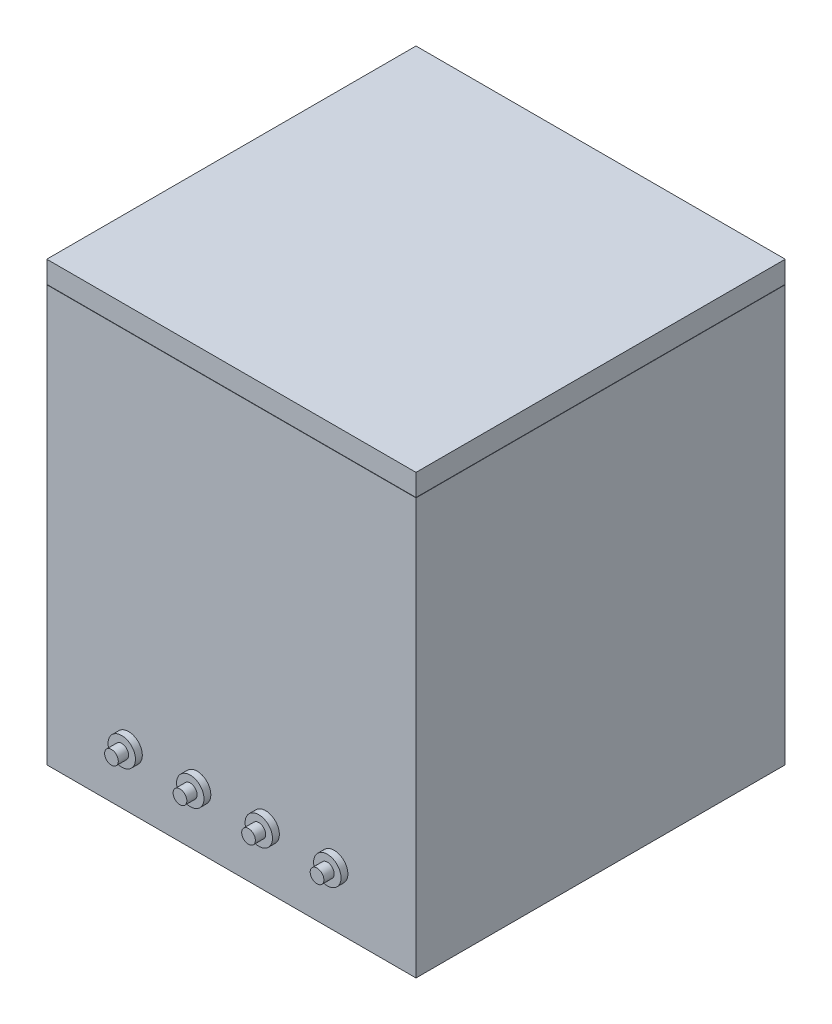
ISO-10303-21;
HEADER;
FILE_DESCRIPTION(('STEP AP214'),'2;1');
FILE_NAME('part.step','',(''),(''),'','','');
FILE_SCHEMA(('AUTOMOTIVE_DESIGN { 1 0 10303 214 1 1 1 1 }'));
ENDSEC;
DATA;
#1=APPLICATION_CONTEXT('core data for automotive mechanical design processes');
#2=APPLICATION_PROTOCOL_DEFINITION('international standard','automotive_design',2000,#1);
#3=PRODUCT_CONTEXT('',#1,'mechanical');
#4=PRODUCT('Part','Part','',(#3));
#5=PRODUCT_RELATED_PRODUCT_CATEGORY('part','',(#4));
#6=PRODUCT_DEFINITION_FORMATION('','',#4);
#7=PRODUCT_DEFINITION_CONTEXT('part definition',#1,'design');
#8=PRODUCT_DEFINITION('design','',#6,#7);
#9=PRODUCT_DEFINITION_SHAPE('','',#8);
#10=(LENGTH_UNIT() NAMED_UNIT(*) SI_UNIT(.MILLI.,.METRE.));
#11=(NAMED_UNIT(*) PLANE_ANGLE_UNIT() SI_UNIT($,.RADIAN.));
#12=(NAMED_UNIT(*) SI_UNIT($,.STERADIAN.) SOLID_ANGLE_UNIT());
#13=UNCERTAINTY_MEASURE_WITH_UNIT(LENGTH_MEASURE(1.E-05),#10,'distance_accuracy_value','');
#14=(GEOMETRIC_REPRESENTATION_CONTEXT(3) GLOBAL_UNCERTAINTY_ASSIGNED_CONTEXT((#13)) GLOBAL_UNIT_ASSIGNED_CONTEXT((#10,
#11,#12)) REPRESENTATION_CONTEXT('',''));
#15=CARTESIAN_POINT('',(0.,0.,0.));
#16=DIRECTION('',(0.,0.,1.));
#17=DIRECTION('',(1.,0.,0.));
#18=AXIS2_PLACEMENT_3D('',#15,#16,#17);
#19=CARTESIAN_POINT('',(53.8815367264149,121.45,-53.881536726415));
#20=DIRECTION('',(-1.,0.,0.));
#21=DIRECTION('',(0.,0.,1.));
#22=AXIS2_PLACEMENT_3D('',#19,#20,#21);
#23=PLANE('',#22);
#24=DIRECTION('',(0.,0.,-1.));
#25=VECTOR('',#24,1.);
#26=CARTESIAN_POINT('',(53.8815367264149,115.1,-53.881536726415));
#27=LINE('',#26,#25);
#28=CARTESIAN_POINT('',(53.8815367264149,115.1,53.881536726415));
#29=VERTEX_POINT('',#28);
#30=CARTESIAN_POINT('',(53.8815367264149,115.1,-53.881536726415));
#31=VERTEX_POINT('',#30);
#32=EDGE_CURVE('E117',#29,#31,#27,.T.);
#33=ORIENTED_EDGE('',*,*,#32,.T.);
#34=DIRECTION('',(0.,-1.,0.));
#35=VECTOR('',#34,1.);
#36=CARTESIAN_POINT('',(53.8815367264149,121.45,-53.881536726415));
#37=LINE('',#36,#35);
#38=CARTESIAN_POINT('',(53.8815367264149,121.45,-53.881536726415));
#39=VERTEX_POINT('',#38);
#40=EDGE_CURVE('E12',#39,#31,#37,.T.);
#41=ORIENTED_EDGE('',*,*,#40,.F.);
#42=DIRECTION('',(0.,0.,-1.));
#43=VECTOR('',#42,1.);
#44=CARTESIAN_POINT('',(53.8815367264149,121.45,-53.881536726415));
#45=LINE('',#44,#43);
#46=CARTESIAN_POINT('',(53.8815367264149,121.45,53.881536726415));
#47=VERTEX_POINT('',#46);
#48=EDGE_CURVE('E105',#47,#39,#45,.T.);
#49=ORIENTED_EDGE('',*,*,#48,.F.);
#50=DIRECTION('',(0.,-1.,0.));
#51=VECTOR('',#50,1.);
#52=CARTESIAN_POINT('',(53.8815367264149,121.45,53.881536726415));
#53=LINE('',#52,#51);
#54=EDGE_CURVE('E113',#47,#29,#53,.T.);
#55=ORIENTED_EDGE('',*,*,#54,.T.);
#56=EDGE_LOOP('',(#33,#41,#49,#55));
#57=FACE_BOUND('',#56,.T.);
#58=ADVANCED_FACE('F54',(#57),#23,.F.);
#59=CARTESIAN_POINT('',(-53.8815367264149,121.45,-53.881536726415));
#60=DIRECTION('',(0.,0.,1.));
#61=DIRECTION('',(1.,0.,0.));
#62=AXIS2_PLACEMENT_3D('',#59,#60,#61);
#63=PLANE('',#62);
#64=DIRECTION('',(-1.,0.,0.));
#65=VECTOR('',#64,1.);
#66=CARTESIAN_POINT('',(-53.8815367264149,115.1,-53.881536726415));
#67=LINE('',#66,#65);
#68=CARTESIAN_POINT('',(-53.8815367264149,115.1,-53.881536726415));
#69=VERTEX_POINT('',#68);
#70=EDGE_CURVE('E109',#31,#69,#67,.T.);
#71=ORIENTED_EDGE('',*,*,#70,.T.);
#72=DIRECTION('',(0.,-1.,0.));
#73=VECTOR('',#72,1.);
#74=CARTESIAN_POINT('',(-53.8815367264149,121.45,-53.881536726415));
#75=LINE('',#74,#73);
#76=CARTESIAN_POINT('',(-53.8815367264149,121.45,-53.881536726415));
#77=VERTEX_POINT('',#76);
#78=EDGE_CURVE('E62',#77,#69,#75,.T.);
#79=ORIENTED_EDGE('',*,*,#78,.F.);
#80=DIRECTION('',(-1.,0.,0.));
#81=VECTOR('',#80,1.);
#82=CARTESIAN_POINT('',(-53.8815367264149,121.45,-53.881536726415));
#83=LINE('',#82,#81);
#84=EDGE_CURVE('E100',#39,#77,#83,.T.);
#85=ORIENTED_EDGE('',*,*,#84,.F.);
#86=ORIENTED_EDGE('',*,*,#40,.T.);
#87=EDGE_LOOP('',(#71,#79,#85,#86));
#88=FACE_BOUND('',#87,.T.);
#89=ADVANCED_FACE('F108',(#88),#63,.F.);
#90=CARTESIAN_POINT('',(-53.8815367264149,121.45,-53.881536726415));
#91=DIRECTION('',(1.,0.,0.));
#92=DIRECTION('',(0.,0.,-1.));
#93=AXIS2_PLACEMENT_3D('',#90,#91,#92);
#94=PLANE('',#93);
#95=DIRECTION('',(0.,0.,1.));
#96=VECTOR('',#95,1.);
#97=CARTESIAN_POINT('',(-53.8815367264149,115.1,-53.881536726415));
#98=LINE('',#97,#96);
#99=CARTESIAN_POINT('',(-53.8815367264149,115.1,53.881536726415));
#100=VERTEX_POINT('',#99);
#101=EDGE_CURVE('E87',#69,#100,#98,.T.);
#102=ORIENTED_EDGE('',*,*,#101,.T.);
#103=DIRECTION('',(0.,-1.,0.));
#104=VECTOR('',#103,1.);
#105=CARTESIAN_POINT('',(-53.8815367264149,121.45,53.881536726415));
#106=LINE('',#105,#104);
#107=CARTESIAN_POINT('',(-53.8815367264149,121.45,53.881536726415));
#108=VERTEX_POINT('',#107);
#109=EDGE_CURVE('E110',#108,#100,#106,.T.);
#110=ORIENTED_EDGE('',*,*,#109,.F.);
#111=DIRECTION('',(0.,0.,1.));
#112=VECTOR('',#111,1.);
#113=CARTESIAN_POINT('',(-53.8815367264149,121.45,-53.881536726415));
#114=LINE('',#113,#112);
#115=EDGE_CURVE('E103',#77,#108,#114,.T.);
#116=ORIENTED_EDGE('',*,*,#115,.F.);
#117=ORIENTED_EDGE('',*,*,#78,.T.);
#118=EDGE_LOOP('',(#102,#110,#116,#117));
#119=FACE_BOUND('',#118,.T.);
#120=ADVANCED_FACE('F111',(#119),#94,.F.);
#121=CARTESIAN_POINT('',(-53.8815367264149,121.45,53.881536726415));
#122=DIRECTION('',(0.,0.,-1.));
#123=DIRECTION('',(-1.,0.,0.));
#124=AXIS2_PLACEMENT_3D('',#121,#122,#123);
#125=PLANE('',#124);
#126=DIRECTION('',(1.,0.,0.));
#127=VECTOR('',#126,1.);
#128=CARTESIAN_POINT('',(-53.8815367264149,115.1,53.881536726415));
#129=LINE('',#128,#127);
#130=EDGE_CURVE('E93',#100,#29,#129,.T.);
#131=ORIENTED_EDGE('',*,*,#130,.T.);
#132=ORIENTED_EDGE('',*,*,#54,.F.);
#133=DIRECTION('',(1.,0.,0.));
#134=VECTOR('',#133,1.);
#135=CARTESIAN_POINT('',(-53.8815367264149,121.45,53.881536726415));
#136=LINE('',#135,#134);
#137=EDGE_CURVE('E70',#108,#47,#136,.T.);
#138=ORIENTED_EDGE('',*,*,#137,.F.);
#139=ORIENTED_EDGE('',*,*,#109,.T.);
#140=EDGE_LOOP('',(#131,#132,#138,#139));
#141=FACE_BOUND('',#140,.T.);
#142=ADVANCED_FACE('F124',(#141),#125,.F.);
#143=CARTESIAN_POINT('',(0.,121.45,0.));
#144=DIRECTION('',(0.,1.,0.));
#145=DIRECTION('',(0.,0.,1.));
#146=AXIS2_PLACEMENT_3D('',#143,#144,#145);
#147=PLANE('',#146);
#148=ORIENTED_EDGE('',*,*,#48,.T.);
#149=ORIENTED_EDGE('',*,*,#84,.T.);
#150=ORIENTED_EDGE('',*,*,#115,.T.);
#151=ORIENTED_EDGE('',*,*,#137,.T.);
#152=EDGE_LOOP('',(#148,#149,#150,#151));
#153=FACE_BOUND('',#152,.T.);
#154=ADVANCED_FACE('F101',(#153),#147,.T.);
#155=CARTESIAN_POINT('',(0.,115.1,0.));
#156=DIRECTION('',(0.,1.,0.));
#157=DIRECTION('',(0.,0.,1.));
#158=AXIS2_PLACEMENT_3D('',#155,#156,#157);
#159=PLANE('',#158);
#160=ORIENTED_EDGE('',*,*,#32,.F.);
#161=ORIENTED_EDGE('',*,*,#130,.F.);
#162=ORIENTED_EDGE('',*,*,#101,.F.);
#163=ORIENTED_EDGE('',*,*,#70,.F.);
#164=EDGE_LOOP('',(#160,#161,#162,#163));
#165=FACE_BOUND('',#164,.T.);
#166=ADVANCED_FACE('F127',(#165),#159,.F.);
#167=CLOSED_SHELL('',(#58,#89,#120,#142,#154,#166));
#168=MANIFOLD_SOLID_BREP('B2',#167);
#169=CARTESIAN_POINT('',(0.,115.,0.));
#170=DIRECTION('',(0.,1.,0.));
#171=DIRECTION('',(0.,0.,1.));
#172=AXIS2_PLACEMENT_3D('',#169,#170,#171);
#173=PLANE('',#172);
#174=DIRECTION('',(0.,0.,-1.));
#175=VECTOR('',#174,1.);
#176=CARTESIAN_POINT('',(53.8815367264149,115.,-53.8815367264149));
#177=LINE('',#176,#175);
#178=CARTESIAN_POINT('',(53.8815367264149,115.,53.881536726415));
#179=VERTEX_POINT('',#178);
#180=CARTESIAN_POINT('',(53.8815367264149,115.,-53.8815367264149));
#181=VERTEX_POINT('',#180);
#182=EDGE_CURVE('E251',#179,#181,#177,.T.);
#183=ORIENTED_EDGE('',*,*,#182,.T.);
#184=DIRECTION('',(-1.,0.,0.));
#185=VECTOR('',#184,1.);
#186=CARTESIAN_POINT('',(-53.8815367264149,115.,-53.8815367264149));
#187=LINE('',#186,#185);
#188=CARTESIAN_POINT('',(-53.8815367264149,115.,-53.8815367264149));
#189=VERTEX_POINT('',#188);
#190=EDGE_CURVE('E325',#181,#189,#187,.T.);
#191=ORIENTED_EDGE('',*,*,#190,.T.);
#192=DIRECTION('',(0.,0.,1.));
#193=VECTOR('',#192,1.);
#194=CARTESIAN_POINT('',(-53.8815367264149,115.,-53.8815367264149));
#195=LINE('',#194,#193);
#196=CARTESIAN_POINT('',(-53.8815367264149,115.,53.881536726415));
#197=VERTEX_POINT('',#196);
#198=EDGE_CURVE('E328',#189,#197,#195,.T.);
#199=ORIENTED_EDGE('',*,*,#198,.T.);
#200=DIRECTION('',(1.,0.,0.));
#201=VECTOR('',#200,1.);
#202=CARTESIAN_POINT('',(-53.8815367264149,115.,53.881536726415));
#203=LINE('',#202,#201);
#204=EDGE_CURVE('E204',#197,#179,#203,.T.);
#205=ORIENTED_EDGE('',*,*,#204,.T.);
#206=EDGE_LOOP('',(#183,#191,#199,#205));
#207=FACE_BOUND('',#206,.T.);
#208=DIRECTION('',(-1.,0.,0.));
#209=VECTOR('',#208,1.);
#210=CARTESIAN_POINT('',(-47.5315367264149,115.,-47.5315367264149));
#211=LINE('',#210,#209);
#212=CARTESIAN_POINT('',(47.5315367264149,115.,-47.5315367264149));
#213=VERTEX_POINT('',#212);
#214=CARTESIAN_POINT('',(-47.5315367264149,115.,-47.5315367264149));
#215=VERTEX_POINT('',#214);
#216=EDGE_CURVE('E287',#213,#215,#211,.T.);
#217=ORIENTED_EDGE('',*,*,#216,.F.);
#218=DIRECTION('',(0.,0.,-1.));
#219=VECTOR('',#218,1.);
#220=CARTESIAN_POINT('',(47.5315367264149,115.,-47.5315367264149));
#221=LINE('',#220,#219);
#222=CARTESIAN_POINT('',(47.5315367264149,115.,47.5315367264149));
#223=VERTEX_POINT('',#222);
#224=EDGE_CURVE('E284',#223,#213,#221,.T.);
#225=ORIENTED_EDGE('',*,*,#224,.F.);
#226=DIRECTION('',(1.,0.,0.));
#227=VECTOR('',#226,1.);
#228=CARTESIAN_POINT('',(-47.5315367264149,115.,47.5315367264149));
#229=LINE('',#228,#227);
#230=CARTESIAN_POINT('',(-47.5315367264149,115.,47.5315367264149));
#231=VERTEX_POINT('',#230);
#232=EDGE_CURVE('E294',#231,#223,#229,.T.);
#233=ORIENTED_EDGE('',*,*,#232,.F.);
#234=DIRECTION('',(0.,0.,1.));
#235=VECTOR('',#234,1.);
#236=CARTESIAN_POINT('',(-47.5315367264149,115.,-47.5315367264149));
#237=LINE('',#236,#235);
#238=EDGE_CURVE('E291',#215,#231,#237,.T.);
#239=ORIENTED_EDGE('',*,*,#238,.F.);
#240=EDGE_LOOP('',(#217,#225,#233,#239));
#241=FACE_BOUND('',#240,.T.);
#242=ADVANCED_FACE('F178',(#207,#241),#173,.T.);
#243=CARTESIAN_POINT('',(53.8815367264149,115.,-53.8815367264149));
#244=DIRECTION('',(-1.,0.,0.));
#245=DIRECTION('',(0.,0.,1.));
#246=AXIS2_PLACEMENT_3D('',#243,#244,#245);
#247=PLANE('',#246);
#248=DIRECTION('',(0.,-1.,0.));
#249=VECTOR('',#248,1.);
#250=CARTESIAN_POINT('',(53.8815367264149,115.,53.881536726415));
#251=LINE('',#250,#249);
#252=CARTESIAN_POINT('',(53.8815367264149,-6.35,53.8815367264149));
#253=VERTEX_POINT('',#252);
#254=EDGE_CURVE('E246',#179,#253,#251,.T.);
#255=ORIENTED_EDGE('',*,*,#254,.T.);
#256=DIRECTION('',(0.,0.,1.));
#257=VECTOR('',#256,1.);
#258=CARTESIAN_POINT('',(53.8815367264149,-6.35,53.8815367264149));
#259=LINE('',#258,#257);
#260=CARTESIAN_POINT('',(53.8815367264149,-6.35,-53.8815367264149));
#261=VERTEX_POINT('',#260);
#262=EDGE_CURVE('E250',#261,#253,#259,.T.);
#263=ORIENTED_EDGE('',*,*,#262,.F.);
#264=DIRECTION('',(0.,-1.,0.));
#265=VECTOR('',#264,1.);
#266=CARTESIAN_POINT('',(53.8815367264149,115.,-53.8815367264149));
#267=LINE('',#266,#265);
#268=EDGE_CURVE('E52',#181,#261,#267,.T.);
#269=ORIENTED_EDGE('',*,*,#268,.F.);
#270=ORIENTED_EDGE('',*,*,#182,.F.);
#271=EDGE_LOOP('',(#255,#263,#269,#270));
#272=FACE_BOUND('',#271,.T.);
#273=ADVANCED_FACE('F180',(#272),#247,.F.);
#274=CARTESIAN_POINT('',(-53.8815367264149,115.,-53.8815367264149));
#275=DIRECTION('',(0.,0.,1.));
#276=DIRECTION('',(1.,0.,0.));
#277=AXIS2_PLACEMENT_3D('',#274,#275,#276);
#278=PLANE('',#277);
#279=ORIENTED_EDGE('',*,*,#268,.T.);
#280=DIRECTION('',(1.,0.,0.));
#281=VECTOR('',#280,1.);
#282=CARTESIAN_POINT('',(-53.8815367264149,-6.35,-53.8815367264149));
#283=LINE('',#282,#281);
#284=CARTESIAN_POINT('',(-53.8815367264149,-6.35,-53.8815367264149));
#285=VERTEX_POINT('',#284);
#286=EDGE_CURVE('E269',#285,#261,#283,.T.);
#287=ORIENTED_EDGE('',*,*,#286,.F.);
#288=DIRECTION('',(0.,-1.,0.));
#289=VECTOR('',#288,1.);
#290=CARTESIAN_POINT('',(-53.8815367264149,115.,-53.8815367264149));
#291=LINE('',#290,#289);
#292=EDGE_CURVE('E188',#189,#285,#291,.T.);
#293=ORIENTED_EDGE('',*,*,#292,.F.);
#294=ORIENTED_EDGE('',*,*,#190,.F.);
#295=EDGE_LOOP('',(#279,#287,#293,#294));
#296=FACE_BOUND('',#295,.T.);
#297=ADVANCED_FACE('F432',(#296),#278,.F.);
#298=CARTESIAN_POINT('',(-53.8815367264149,115.,-53.8815367264149));
#299=DIRECTION('',(1.,0.,0.));
#300=DIRECTION('',(0.,0.,-1.));
#301=AXIS2_PLACEMENT_3D('',#298,#299,#300);
#302=PLANE('',#301);
#303=ORIENTED_EDGE('',*,*,#292,.T.);
#304=DIRECTION('',(0.,0.,-1.));
#305=VECTOR('',#304,1.);
#306=CARTESIAN_POINT('',(-53.8815367264149,-6.35,53.8815367264149));
#307=LINE('',#306,#305);
#308=CARTESIAN_POINT('',(-53.8815367264149,-6.35,53.8815367264149));
#309=VERTEX_POINT('',#308);
#310=EDGE_CURVE('E264',#309,#285,#307,.T.);
#311=ORIENTED_EDGE('',*,*,#310,.F.);
#312=DIRECTION('',(0.,-1.,0.));
#313=VECTOR('',#312,1.);
#314=CARTESIAN_POINT('',(-53.8815367264149,115.,53.881536726415));
#315=LINE('',#314,#313);
#316=EDGE_CURVE('E254',#197,#309,#315,.T.);
#317=ORIENTED_EDGE('',*,*,#316,.F.);
#318=ORIENTED_EDGE('',*,*,#198,.F.);
#319=EDGE_LOOP('',(#303,#311,#317,#318));
#320=FACE_BOUND('',#319,.T.);
#321=ADVANCED_FACE('F440',(#320),#302,.F.);
#322=CARTESIAN_POINT('',(-53.8815367264149,115.,53.881536726415));
#323=DIRECTION('',(0.,0.,-1.));
#324=DIRECTION('',(-1.,0.,0.));
#325=AXIS2_PLACEMENT_3D('',#322,#323,#324);
#326=PLANE('',#325);
#327=CARTESIAN_POINT('',(30.,10.,53.881536726415));
#328=DIRECTION('',(0.,0.,-1.));
#329=DIRECTION('',(-1.,0.,0.));
#330=AXIS2_PLACEMENT_3D('',#327,#328,#329);
#331=CIRCLE('',#330,4.);
#332=CARTESIAN_POINT('',(26.,10.,53.881536726415));
#333=VERTEX_POINT('',#332);
#334=EDGE_CURVE('E400',#333,#333,#331,.T.);
#335=ORIENTED_EDGE('',*,*,#334,.T.);
#336=EDGE_LOOP('',(#335));
#337=FACE_BOUND('',#336,.T.);
#338=CARTESIAN_POINT('',(10.,10.,53.881536726415));
#339=DIRECTION('',(0.,0.,-1.));
#340=DIRECTION('',(-1.,0.,0.));
#341=AXIS2_PLACEMENT_3D('',#338,#339,#340);
#342=CIRCLE('',#341,4.);
#343=CARTESIAN_POINT('',(6.,10.,53.881536726415));
#344=VERTEX_POINT('',#343);
#345=EDGE_CURVE('E384',#344,#344,#342,.T.);
#346=ORIENTED_EDGE('',*,*,#345,.T.);
#347=EDGE_LOOP('',(#346));
#348=FACE_BOUND('',#347,.T.);
#349=CARTESIAN_POINT('',(-10.,10.,53.881536726415));
#350=DIRECTION('',(0.,0.,-1.));
#351=DIRECTION('',(-1.,0.,0.));
#352=AXIS2_PLACEMENT_3D('',#349,#350,#351);
#353=CIRCLE('',#352,4.);
#354=CARTESIAN_POINT('',(-14.,10.,53.881536726415));
#355=VERTEX_POINT('',#354);
#356=EDGE_CURVE('E368',#355,#355,#353,.T.);
#357=ORIENTED_EDGE('',*,*,#356,.T.);
#358=EDGE_LOOP('',(#357));
#359=FACE_BOUND('',#358,.T.);
#360=CARTESIAN_POINT('',(-30.,10.,53.881536726415));
#361=DIRECTION('',(0.,0.,-1.));
#362=DIRECTION('',(-1.,0.,0.));
#363=AXIS2_PLACEMENT_3D('',#360,#361,#362);
#364=CIRCLE('',#363,4.);
#365=CARTESIAN_POINT('',(-34.,10.,53.881536726415));
#366=VERTEX_POINT('',#365);
#367=EDGE_CURVE('E352',#366,#366,#364,.T.);
#368=ORIENTED_EDGE('',*,*,#367,.T.);
#369=EDGE_LOOP('',(#368));
#370=FACE_BOUND('',#369,.T.);
#371=ORIENTED_EDGE('',*,*,#316,.T.);
#372=DIRECTION('',(-1.,0.,0.));
#373=VECTOR('',#372,1.);
#374=CARTESIAN_POINT('',(-53.8815367264149,-6.35,53.8815367264149));
#375=LINE('',#374,#373);
#376=EDGE_CURVE('E257',#253,#309,#375,.T.);
#377=ORIENTED_EDGE('',*,*,#376,.F.);
#378=ORIENTED_EDGE('',*,*,#254,.F.);
#379=ORIENTED_EDGE('',*,*,#204,.F.);
#380=EDGE_LOOP('',(#371,#377,#378,#379));
#381=FACE_BOUND('',#380,.T.);
#382=ADVANCED_FACE('F258',(#337,#348,#359,#370,#381),#326,.F.);
#383=CARTESIAN_POINT('',(47.5315367264149,115.,-47.5315367264149));
#384=DIRECTION('',(-1.,0.,0.));
#385=DIRECTION('',(0.,0.,1.));
#386=AXIS2_PLACEMENT_3D('',#383,#384,#385);
#387=PLANE('',#386);
#388=DIRECTION('',(0.,0.,-1.));
#389=VECTOR('',#388,1.);
#390=CARTESIAN_POINT('',(47.5315367264149,0.,-47.5315367264149));
#391=LINE('',#390,#389);
#392=CARTESIAN_POINT('',(47.5315367264149,0.,47.5315367264149));
#393=VERTEX_POINT('',#392);
#394=CARTESIAN_POINT('',(47.5315367264149,0.,-47.5315367264149));
#395=VERTEX_POINT('',#394);
#396=EDGE_CURVE('E283',#393,#395,#391,.T.);
#397=ORIENTED_EDGE('',*,*,#396,.F.);
#398=DIRECTION('',(0.,-1.,0.));
#399=VECTOR('',#398,1.);
#400=CARTESIAN_POINT('',(47.5315367264149,115.,47.5315367264149));
#401=LINE('',#400,#399);
#402=EDGE_CURVE('E297',#223,#393,#401,.T.);
#403=ORIENTED_EDGE('',*,*,#402,.F.);
#404=ORIENTED_EDGE('',*,*,#224,.T.);
#405=DIRECTION('',(0.,-1.,0.));
#406=VECTOR('',#405,1.);
#407=CARTESIAN_POINT('',(47.5315367264149,115.,-47.5315367264149));
#408=LINE('',#407,#406);
#409=EDGE_CURVE('E319',#213,#395,#408,.T.);
#410=ORIENTED_EDGE('',*,*,#409,.T.);
#411=EDGE_LOOP('',(#397,#403,#404,#410));
#412=FACE_BOUND('',#411,.T.);
#413=ADVANCED_FACE('F436',(#412),#387,.T.);
#414=CARTESIAN_POINT('',(-47.5315367264149,115.,-47.5315367264149));
#415=DIRECTION('',(0.,0.,1.));
#416=DIRECTION('',(1.,0.,0.));
#417=AXIS2_PLACEMENT_3D('',#414,#415,#416);
#418=PLANE('',#417);
#419=DIRECTION('',(-1.,0.,0.));
#420=VECTOR('',#419,1.);
#421=CARTESIAN_POINT('',(-47.5315367264149,0.,-47.5315367264149));
#422=LINE('',#421,#420);
#423=CARTESIAN_POINT('',(-47.5315367264149,0.,-47.5315367264149));
#424=VERTEX_POINT('',#423);
#425=EDGE_CURVE('E301',#395,#424,#422,.T.);
#426=ORIENTED_EDGE('',*,*,#425,.F.);
#427=ORIENTED_EDGE('',*,*,#409,.F.);
#428=ORIENTED_EDGE('',*,*,#216,.T.);
#429=DIRECTION('',(0.,-1.,0.));
#430=VECTOR('',#429,1.);
#431=CARTESIAN_POINT('',(-47.5315367264149,115.,-47.5315367264149));
#432=LINE('',#431,#430);
#433=EDGE_CURVE('E316',#215,#424,#432,.T.);
#434=ORIENTED_EDGE('',*,*,#433,.T.);
#435=EDGE_LOOP('',(#426,#427,#428,#434));
#436=FACE_BOUND('',#435,.T.);
#437=ADVANCED_FACE('F465',(#436),#418,.T.);
#438=CARTESIAN_POINT('',(-47.5315367264149,115.,-47.5315367264149));
#439=DIRECTION('',(1.,0.,0.));
#440=DIRECTION('',(0.,0.,-1.));
#441=AXIS2_PLACEMENT_3D('',#438,#439,#440);
#442=PLANE('',#441);
#443=DIRECTION('',(0.,0.,1.));
#444=VECTOR('',#443,1.);
#445=CARTESIAN_POINT('',(-47.5315367264149,0.,-47.5315367264149));
#446=LINE('',#445,#444);
#447=CARTESIAN_POINT('',(-47.5315367264149,0.,47.5315367264149));
#448=VERTEX_POINT('',#447);
#449=EDGE_CURVE('E305',#424,#448,#446,.T.);
#450=ORIENTED_EDGE('',*,*,#449,.F.);
#451=ORIENTED_EDGE('',*,*,#433,.F.);
#452=ORIENTED_EDGE('',*,*,#238,.T.);
#453=DIRECTION('',(0.,-1.,0.));
#454=VECTOR('',#453,1.);
#455=CARTESIAN_POINT('',(-47.5315367264149,115.,47.5315367264149));
#456=LINE('',#455,#454);
#457=EDGE_CURVE('E196',#231,#448,#456,.T.);
#458=ORIENTED_EDGE('',*,*,#457,.T.);
#459=EDGE_LOOP('',(#450,#451,#452,#458));
#460=FACE_BOUND('',#459,.T.);
#461=ADVANCED_FACE('F474',(#460),#442,.T.);
#462=CARTESIAN_POINT('',(-47.5315367264149,115.,47.5315367264149));
#463=DIRECTION('',(0.,0.,-1.));
#464=DIRECTION('',(-1.,0.,0.));
#465=AXIS2_PLACEMENT_3D('',#462,#463,#464);
#466=PLANE('',#465);
#467=DIRECTION('',(1.,0.,0.));
#468=VECTOR('',#467,1.);
#469=CARTESIAN_POINT('',(-47.5315367264149,0.,47.5315367264149));
#470=LINE('',#469,#468);
#471=EDGE_CURVE('E288',#448,#393,#470,.T.);
#472=ORIENTED_EDGE('',*,*,#471,.F.);
#473=ORIENTED_EDGE('',*,*,#457,.F.);
#474=ORIENTED_EDGE('',*,*,#232,.T.);
#475=ORIENTED_EDGE('',*,*,#402,.T.);
#476=EDGE_LOOP('',(#472,#473,#474,#475));
#477=FACE_BOUND('',#476,.T.);
#478=ADVANCED_FACE('F482',(#477),#466,.T.);
#479=CARTESIAN_POINT('',(0.,0.,0.));
#480=DIRECTION('',(0.,-1.,0.));
#481=DIRECTION('',(0.,0.,-1.));
#482=AXIS2_PLACEMENT_3D('',#479,#480,#481);
#483=PLANE('',#482);
#484=ORIENTED_EDGE('',*,*,#471,.T.);
#485=ORIENTED_EDGE('',*,*,#396,.T.);
#486=ORIENTED_EDGE('',*,*,#425,.T.);
#487=ORIENTED_EDGE('',*,*,#449,.T.);
#488=EDGE_LOOP('',(#484,#485,#486,#487));
#489=FACE_BOUND('',#488,.T.);
#490=ADVANCED_FACE('F491',(#489),#483,.F.);
#491=CARTESIAN_POINT('',(0.,-6.35,0.));
#492=DIRECTION('',(0.,-1.,0.));
#493=DIRECTION('',(0.,0.,-1.));
#494=AXIS2_PLACEMENT_3D('',#491,#492,#493);
#495=PLANE('',#494);
#496=CARTESIAN_POINT('',(-20.,-6.35,-25.));
#497=DIRECTION('',(0.,-1.,0.));
#498=DIRECTION('',(0.,0.,-1.));
#499=AXIS2_PLACEMENT_3D('',#496,#497,#498);
#500=CIRCLE('',#499,2.5);
#501=CARTESIAN_POINT('',(-20.,-6.35,-27.5));
#502=VERTEX_POINT('',#501);
#503=EDGE_CURVE('E182',#502,#502,#500,.T.);
#504=ORIENTED_EDGE('',*,*,#503,.F.);
#505=EDGE_LOOP('',(#504));
#506=FACE_BOUND('',#505,.T.);
#507=CARTESIAN_POINT('',(20.,-6.35,-25.));
#508=DIRECTION('',(0.,-1.,0.));
#509=DIRECTION('',(0.,0.,-1.));
#510=AXIS2_PLACEMENT_3D('',#507,#508,#509);
#511=CIRCLE('',#510,2.5);
#512=CARTESIAN_POINT('',(20.,-6.35,-27.5));
#513=VERTEX_POINT('',#512);
#514=EDGE_CURVE('E274',#513,#513,#511,.T.);
#515=ORIENTED_EDGE('',*,*,#514,.F.);
#516=EDGE_LOOP('',(#515));
#517=FACE_BOUND('',#516,.T.);
#518=ORIENTED_EDGE('',*,*,#262,.T.);
#519=ORIENTED_EDGE('',*,*,#376,.T.);
#520=ORIENTED_EDGE('',*,*,#310,.T.);
#521=ORIENTED_EDGE('',*,*,#286,.T.);
#522=EDGE_LOOP('',(#518,#519,#520,#521));
#523=FACE_BOUND('',#522,.T.);
#524=ADVANCED_FACE('F267',(#506,#517,#523),#495,.T.);
#525=CARTESIAN_POINT('',(20.,-3.175,-25.));
#526=DIRECTION('',(0.,-1.,0.));
#527=DIRECTION('',(0.,0.,-1.));
#528=AXIS2_PLACEMENT_3D('',#525,#526,#527);
#529=CYLINDRICAL_SURFACE('',#528,2.5);
#530=ORIENTED_EDGE('',*,*,#514,.T.);
#531=EDGE_LOOP('',(#530));
#532=FACE_BOUND('',#531,.T.);
#533=CARTESIAN_POINT('',(20.,-3.175,-25.));
#534=DIRECTION('',(0.,-1.,0.));
#535=DIRECTION('',(0.,0.,-1.));
#536=AXIS2_PLACEMENT_3D('',#533,#534,#535);
#537=CIRCLE('',#536,2.5);
#538=CARTESIAN_POINT('',(20.,-3.175,-27.5));
#539=VERTEX_POINT('',#538);
#540=EDGE_CURVE('E276',#539,#539,#537,.T.);
#541=ORIENTED_EDGE('',*,*,#540,.F.);
#542=EDGE_LOOP('',(#541));
#543=FACE_BOUND('',#542,.T.);
#544=ADVANCED_FACE('F507',(#532,#543),#529,.F.);
#545=CARTESIAN_POINT('',(20.,-3.175,-25.));
#546=DIRECTION('',(0.,-1.,0.));
#547=DIRECTION('',(0.,0.,-1.));
#548=AXIS2_PLACEMENT_3D('',#545,#546,#547);
#549=PLANE('',#548);
#550=ORIENTED_EDGE('',*,*,#540,.T.);
#551=EDGE_LOOP('',(#550));
#552=FACE_BOUND('',#551,.T.);
#553=ADVANCED_FACE('F516',(#552),#549,.T.);
#554=CARTESIAN_POINT('',(-20.,-3.175,-25.));
#555=DIRECTION('',(0.,-1.,0.));
#556=DIRECTION('',(0.,0.,-1.));
#557=AXIS2_PLACEMENT_3D('',#554,#555,#556);
#558=CYLINDRICAL_SURFACE('',#557,2.5);
#559=ORIENTED_EDGE('',*,*,#503,.T.);
#560=EDGE_LOOP('',(#559));
#561=FACE_BOUND('',#560,.T.);
#562=CARTESIAN_POINT('',(-20.,-3.175,-25.));
#563=DIRECTION('',(0.,-1.,0.));
#564=DIRECTION('',(0.,0.,-1.));
#565=AXIS2_PLACEMENT_3D('',#562,#563,#564);
#566=CIRCLE('',#565,2.5);
#567=CARTESIAN_POINT('',(-20.,-3.175,-27.5));
#568=VERTEX_POINT('',#567);
#569=EDGE_CURVE('E338',#568,#568,#566,.T.);
#570=ORIENTED_EDGE('',*,*,#569,.F.);
#571=EDGE_LOOP('',(#570));
#572=FACE_BOUND('',#571,.T.);
#573=ADVANCED_FACE('F524',(#561,#572),#558,.F.);
#574=CARTESIAN_POINT('',(-20.,-3.175,-25.));
#575=DIRECTION('',(0.,-1.,0.));
#576=DIRECTION('',(0.,0.,-1.));
#577=AXIS2_PLACEMENT_3D('',#574,#575,#576);
#578=PLANE('',#577);
#579=ORIENTED_EDGE('',*,*,#569,.T.);
#580=EDGE_LOOP('',(#579));
#581=FACE_BOUND('',#580,.T.);
#582=ADVANCED_FACE('F533',(#581),#578,.T.);
#583=CARTESIAN_POINT('',(-32.,10.,55.881536726415));
#584=DIRECTION('',(0.,0.,1.));
#585=DIRECTION('',(1.,0.,0.));
#586=AXIS2_PLACEMENT_3D('',#583,#584,#585);
#587=PLANE('',#586);
#588=CARTESIAN_POINT('',(-30.,10.,55.881536726415));
#589=DIRECTION('',(0.,0.,-1.));
#590=DIRECTION('',(-1.,0.,0.));
#591=AXIS2_PLACEMENT_3D('',#588,#589,#590);
#592=CIRCLE('',#591,2.);
#593=CARTESIAN_POINT('',(-32.,10.,55.881536726415));
#594=VERTEX_POINT('',#593);
#595=EDGE_CURVE('E360',#594,#594,#592,.T.);
#596=ORIENTED_EDGE('',*,*,#595,.T.);
#597=EDGE_LOOP('',(#596));
#598=FACE_BOUND('',#597,.T.);
#599=CARTESIAN_POINT('',(-30.,10.,55.881536726415));
#600=DIRECTION('',(0.,0.,-1.));
#601=DIRECTION('',(-1.,0.,0.));
#602=AXIS2_PLACEMENT_3D('',#599,#600,#601);
#603=CIRCLE('',#602,4.);
#604=CARTESIAN_POINT('',(-34.,10.,55.881536726415));
#605=VERTEX_POINT('',#604);
#606=EDGE_CURVE('E347',#605,#605,#603,.T.);
#607=ORIENTED_EDGE('',*,*,#606,.F.);
#608=EDGE_LOOP('',(#607));
#609=FACE_BOUND('',#608,.T.);
#610=ADVANCED_FACE('F542',(#598,#609),#587,.T.);
#611=CARTESIAN_POINT('',(-30.,10.,53.881536726415));
#612=DIRECTION('',(0.,0.,-1.));
#613=DIRECTION('',(-1.,0.,0.));
#614=AXIS2_PLACEMENT_3D('',#611,#612,#613);
#615=CYLINDRICAL_SURFACE('',#614,4.);
#616=ORIENTED_EDGE('',*,*,#606,.T.);
#617=EDGE_LOOP('',(#616));
#618=FACE_BOUND('',#617,.T.);
#619=ORIENTED_EDGE('',*,*,#367,.F.);
#620=EDGE_LOOP('',(#619));
#621=FACE_BOUND('',#620,.T.);
#622=ADVANCED_FACE('F550',(#618,#621),#615,.T.);
#623=CARTESIAN_POINT('',(-30.,10.,58.881536726415));
#624=DIRECTION('',(0.,0.,1.));
#625=DIRECTION('',(1.,0.,0.));
#626=AXIS2_PLACEMENT_3D('',#623,#624,#625);
#627=PLANE('',#626);
#628=CARTESIAN_POINT('',(-30.,10.,58.881536726415));
#629=DIRECTION('',(0.,0.,-1.));
#630=DIRECTION('',(-1.,0.,0.));
#631=AXIS2_PLACEMENT_3D('',#628,#629,#630);
#632=CIRCLE('',#631,2.);
#633=CARTESIAN_POINT('',(-32.,10.,58.881536726415));
#634=VERTEX_POINT('',#633);
#635=EDGE_CURVE('E356',#634,#634,#632,.T.);
#636=ORIENTED_EDGE('',*,*,#635,.F.);
#637=EDGE_LOOP('',(#636));
#638=FACE_BOUND('',#637,.T.);
#639=ADVANCED_FACE('F559',(#638),#627,.T.);
#640=CARTESIAN_POINT('',(-30.,10.,53.881536726415));
#641=DIRECTION('',(0.,0.,-1.));
#642=DIRECTION('',(-1.,0.,0.));
#643=AXIS2_PLACEMENT_3D('',#640,#641,#642);
#644=CYLINDRICAL_SURFACE('',#643,2.);
#645=ORIENTED_EDGE('',*,*,#635,.T.);
#646=EDGE_LOOP('',(#645));
#647=FACE_BOUND('',#646,.T.);
#648=ORIENTED_EDGE('',*,*,#595,.F.);
#649=EDGE_LOOP('',(#648));
#650=FACE_BOUND('',#649,.T.);
#651=ADVANCED_FACE('F568',(#647,#650),#644,.T.);
#652=CARTESIAN_POINT('',(-12.,10.,55.881536726415));
#653=DIRECTION('',(0.,0.,1.));
#654=DIRECTION('',(1.,0.,0.));
#655=AXIS2_PLACEMENT_3D('',#652,#653,#654);
#656=PLANE('',#655);
#657=CARTESIAN_POINT('',(-10.,10.,55.881536726415));
#658=DIRECTION('',(0.,0.,-1.));
#659=DIRECTION('',(-1.,0.,0.));
#660=AXIS2_PLACEMENT_3D('',#657,#658,#659);
#661=CIRCLE('',#660,2.);
#662=CARTESIAN_POINT('',(-12.,10.,55.881536726415));
#663=VERTEX_POINT('',#662);
#664=EDGE_CURVE('E376',#663,#663,#661,.T.);
#665=ORIENTED_EDGE('',*,*,#664,.T.);
#666=EDGE_LOOP('',(#665));
#667=FACE_BOUND('',#666,.T.);
#668=CARTESIAN_POINT('',(-10.,10.,55.881536726415));
#669=DIRECTION('',(0.,0.,-1.));
#670=DIRECTION('',(-1.,0.,0.));
#671=AXIS2_PLACEMENT_3D('',#668,#669,#670);
#672=CIRCLE('',#671,4.);
#673=CARTESIAN_POINT('',(-14.,10.,55.881536726415));
#674=VERTEX_POINT('',#673);
#675=EDGE_CURVE('E364',#674,#674,#672,.T.);
#676=ORIENTED_EDGE('',*,*,#675,.F.);
#677=EDGE_LOOP('',(#676));
#678=FACE_BOUND('',#677,.T.);
#679=ADVANCED_FACE('F576',(#667,#678),#656,.T.);
#680=CARTESIAN_POINT('',(-10.,10.,53.881536726415));
#681=DIRECTION('',(0.,0.,-1.));
#682=DIRECTION('',(-1.,0.,0.));
#683=AXIS2_PLACEMENT_3D('',#680,#681,#682);
#684=CYLINDRICAL_SURFACE('',#683,4.);
#685=ORIENTED_EDGE('',*,*,#675,.T.);
#686=EDGE_LOOP('',(#685));
#687=FACE_BOUND('',#686,.T.);
#688=ORIENTED_EDGE('',*,*,#356,.F.);
#689=EDGE_LOOP('',(#688));
#690=FACE_BOUND('',#689,.T.);
#691=ADVANCED_FACE('F589',(#687,#690),#684,.T.);
#692=CARTESIAN_POINT('',(-10.,10.,58.881536726415));
#693=DIRECTION('',(0.,0.,1.));
#694=DIRECTION('',(1.,0.,0.));
#695=AXIS2_PLACEMENT_3D('',#692,#693,#694);
#696=PLANE('',#695);
#697=CARTESIAN_POINT('',(-10.,10.,58.881536726415));
#698=DIRECTION('',(0.,0.,-1.));
#699=DIRECTION('',(-1.,0.,0.));
#700=AXIS2_PLACEMENT_3D('',#697,#698,#699);
#701=CIRCLE('',#700,2.);
#702=CARTESIAN_POINT('',(-12.,10.,58.881536726415));
#703=VERTEX_POINT('',#702);
#704=EDGE_CURVE('E372',#703,#703,#701,.T.);
#705=ORIENTED_EDGE('',*,*,#704,.F.);
#706=EDGE_LOOP('',(#705));
#707=FACE_BOUND('',#706,.T.);
#708=ADVANCED_FACE('F598',(#707),#696,.T.);
#709=CARTESIAN_POINT('',(-10.,10.,53.881536726415));
#710=DIRECTION('',(0.,0.,-1.));
#711=DIRECTION('',(-1.,0.,0.));
#712=AXIS2_PLACEMENT_3D('',#709,#710,#711);
#713=CYLINDRICAL_SURFACE('',#712,2.);
#714=ORIENTED_EDGE('',*,*,#704,.T.);
#715=EDGE_LOOP('',(#714));
#716=FACE_BOUND('',#715,.T.);
#717=ORIENTED_EDGE('',*,*,#664,.F.);
#718=EDGE_LOOP('',(#717));
#719=FACE_BOUND('',#718,.T.);
#720=ADVANCED_FACE('F607',(#716,#719),#713,.T.);
#721=CARTESIAN_POINT('',(8.,10.,55.881536726415));
#722=DIRECTION('',(0.,0.,1.));
#723=DIRECTION('',(1.,0.,0.));
#724=AXIS2_PLACEMENT_3D('',#721,#722,#723);
#725=PLANE('',#724);
#726=CARTESIAN_POINT('',(10.,10.,55.881536726415));
#727=DIRECTION('',(0.,0.,-1.));
#728=DIRECTION('',(-1.,0.,0.));
#729=AXIS2_PLACEMENT_3D('',#726,#727,#728);
#730=CIRCLE('',#729,2.);
#731=CARTESIAN_POINT('',(8.,10.,55.881536726415));
#732=VERTEX_POINT('',#731);
#733=EDGE_CURVE('E392',#732,#732,#730,.T.);
#734=ORIENTED_EDGE('',*,*,#733,.T.);
#735=EDGE_LOOP('',(#734));
#736=FACE_BOUND('',#735,.T.);
#737=CARTESIAN_POINT('',(10.,10.,55.881536726415));
#738=DIRECTION('',(0.,0.,-1.));
#739=DIRECTION('',(-1.,0.,0.));
#740=AXIS2_PLACEMENT_3D('',#737,#738,#739);
#741=CIRCLE('',#740,4.);
#742=CARTESIAN_POINT('',(6.,10.,55.881536726415));
#743=VERTEX_POINT('',#742);
#744=EDGE_CURVE('E380',#743,#743,#741,.T.);
#745=ORIENTED_EDGE('',*,*,#744,.F.);
#746=EDGE_LOOP('',(#745));
#747=FACE_BOUND('',#746,.T.);
#748=ADVANCED_FACE('F616',(#736,#747),#725,.T.);
#749=CARTESIAN_POINT('',(10.,10.,53.881536726415));
#750=DIRECTION('',(0.,0.,-1.));
#751=DIRECTION('',(-1.,0.,0.));
#752=AXIS2_PLACEMENT_3D('',#749,#750,#751);
#753=CYLINDRICAL_SURFACE('',#752,4.);
#754=ORIENTED_EDGE('',*,*,#744,.T.);
#755=EDGE_LOOP('',(#754));
#756=FACE_BOUND('',#755,.T.);
#757=ORIENTED_EDGE('',*,*,#345,.F.);
#758=EDGE_LOOP('',(#757));
#759=FACE_BOUND('',#758,.T.);
#760=ADVANCED_FACE('F625',(#756,#759),#753,.T.);
#761=CARTESIAN_POINT('',(10.,10.,58.881536726415));
#762=DIRECTION('',(0.,0.,1.));
#763=DIRECTION('',(1.,0.,0.));
#764=AXIS2_PLACEMENT_3D('',#761,#762,#763);
#765=PLANE('',#764);
#766=CARTESIAN_POINT('',(10.,10.,58.881536726415));
#767=DIRECTION('',(0.,0.,-1.));
#768=DIRECTION('',(-1.,0.,0.));
#769=AXIS2_PLACEMENT_3D('',#766,#767,#768);
#770=CIRCLE('',#769,2.);
#771=CARTESIAN_POINT('',(8.,10.,58.881536726415));
#772=VERTEX_POINT('',#771);
#773=EDGE_CURVE('E388',#772,#772,#770,.T.);
#774=ORIENTED_EDGE('',*,*,#773,.F.);
#775=EDGE_LOOP('',(#774));
#776=FACE_BOUND('',#775,.T.);
#777=ADVANCED_FACE('F634',(#776),#765,.T.);
#778=CARTESIAN_POINT('',(10.,10.,53.881536726415));
#779=DIRECTION('',(0.,0.,-1.));
#780=DIRECTION('',(-1.,0.,0.));
#781=AXIS2_PLACEMENT_3D('',#778,#779,#780);
#782=CYLINDRICAL_SURFACE('',#781,2.);
#783=ORIENTED_EDGE('',*,*,#773,.T.);
#784=EDGE_LOOP('',(#783));
#785=FACE_BOUND('',#784,.T.);
#786=ORIENTED_EDGE('',*,*,#733,.F.);
#787=EDGE_LOOP('',(#786));
#788=FACE_BOUND('',#787,.T.);
#789=ADVANCED_FACE('F643',(#785,#788),#782,.T.);
#790=CARTESIAN_POINT('',(28.,10.,55.881536726415));
#791=DIRECTION('',(0.,0.,1.));
#792=DIRECTION('',(1.,0.,0.));
#793=AXIS2_PLACEMENT_3D('',#790,#791,#792);
#794=PLANE('',#793);
#795=CARTESIAN_POINT('',(30.,10.,55.881536726415));
#796=DIRECTION('',(0.,0.,-1.));
#797=DIRECTION('',(-1.,0.,0.));
#798=AXIS2_PLACEMENT_3D('',#795,#796,#797);
#799=CIRCLE('',#798,2.);
#800=CARTESIAN_POINT('',(28.,10.,55.881536726415));
#801=VERTEX_POINT('',#800);
#802=EDGE_CURVE('E408',#801,#801,#799,.T.);
#803=ORIENTED_EDGE('',*,*,#802,.T.);
#804=EDGE_LOOP('',(#803));
#805=FACE_BOUND('',#804,.T.);
#806=CARTESIAN_POINT('',(30.,10.,55.881536726415));
#807=DIRECTION('',(0.,0.,-1.));
#808=DIRECTION('',(-1.,0.,0.));
#809=AXIS2_PLACEMENT_3D('',#806,#807,#808);
#810=CIRCLE('',#809,4.);
#811=CARTESIAN_POINT('',(26.,10.,55.881536726415));
#812=VERTEX_POINT('',#811);
#813=EDGE_CURVE('E396',#812,#812,#810,.T.);
#814=ORIENTED_EDGE('',*,*,#813,.F.);
#815=EDGE_LOOP('',(#814));
#816=FACE_BOUND('',#815,.T.);
#817=ADVANCED_FACE('F413',(#805,#816),#794,.T.);
#818=CARTESIAN_POINT('',(30.,10.,53.881536726415));
#819=DIRECTION('',(0.,0.,-1.));
#820=DIRECTION('',(-1.,0.,0.));
#821=AXIS2_PLACEMENT_3D('',#818,#819,#820);
#822=CYLINDRICAL_SURFACE('',#821,4.);
#823=ORIENTED_EDGE('',*,*,#813,.T.);
#824=EDGE_LOOP('',(#823));
#825=FACE_BOUND('',#824,.T.);
#826=ORIENTED_EDGE('',*,*,#334,.F.);
#827=EDGE_LOOP('',(#826));
#828=FACE_BOUND('',#827,.T.);
#829=ADVANCED_FACE('F424',(#825,#828),#822,.T.);
#830=CARTESIAN_POINT('',(30.,10.,58.881536726415));
#831=DIRECTION('',(0.,0.,1.));
#832=DIRECTION('',(1.,0.,0.));
#833=AXIS2_PLACEMENT_3D('',#830,#831,#832);
#834=PLANE('',#833);
#835=CARTESIAN_POINT('',(30.,10.,58.881536726415));
#836=DIRECTION('',(0.,0.,-1.));
#837=DIRECTION('',(-1.,0.,0.));
#838=AXIS2_PLACEMENT_3D('',#835,#836,#837);
#839=CIRCLE('',#838,2.);
#840=CARTESIAN_POINT('',(28.,10.,58.881536726415));
#841=VERTEX_POINT('',#840);
#842=EDGE_CURVE('E404',#841,#841,#839,.T.);
#843=ORIENTED_EDGE('',*,*,#842,.F.);
#844=EDGE_LOOP('',(#843));
#845=FACE_BOUND('',#844,.T.);
#846=ADVANCED_FACE('F418',(#845),#834,.T.);
#847=CARTESIAN_POINT('',(30.,10.,53.881536726415));
#848=DIRECTION('',(0.,0.,-1.));
#849=DIRECTION('',(-1.,0.,0.));
#850=AXIS2_PLACEMENT_3D('',#847,#848,#849);
#851=CYLINDRICAL_SURFACE('',#850,2.);
#852=ORIENTED_EDGE('',*,*,#842,.T.);
#853=EDGE_LOOP('',(#852));
#854=FACE_BOUND('',#853,.T.);
#855=ORIENTED_EDGE('',*,*,#802,.F.);
#856=EDGE_LOOP('',(#855));
#857=FACE_BOUND('',#856,.T.);
#858=ADVANCED_FACE('F416',(#854,#857),#851,.T.);
#859=CLOSED_SHELL('',(#242,#273,#297,#321,#382,#413,#437,#461,#478,#490,#524,#544,#553,#573,
#582,#610,#622,#639,#651,#679,#691,#708,#720,#748,#760,#777,#789,#817,#829,#846,#858));
#860=MANIFOLD_SOLID_BREP('B6',#859);
#861=ADVANCED_BREP_SHAPE_REPRESENTATION('',(#18,#168,#860),#14);
#862=SHAPE_DEFINITION_REPRESENTATION(#9,#861);
ENDSEC;
END-ISO-10303-21;
